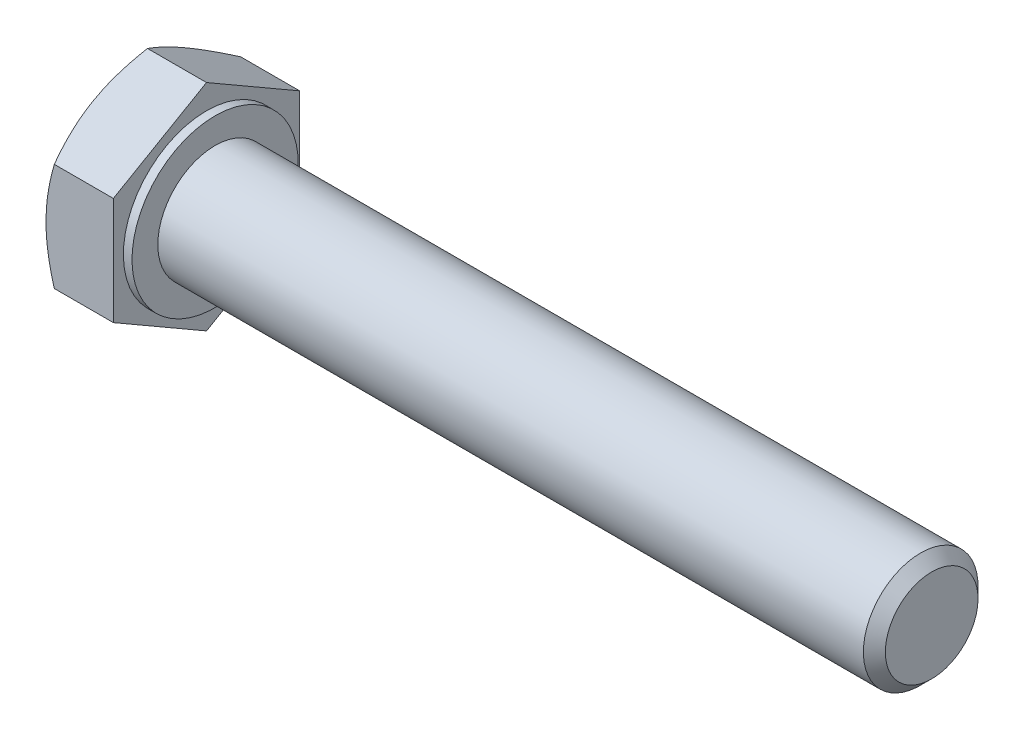
ISO-10303-21;
HEADER;
FILE_DESCRIPTION(('STEP AP214'),'2;1');
FILE_NAME('part.step','',(''),(''),'','','');
FILE_SCHEMA(('AUTOMOTIVE_DESIGN { 1 0 10303 214 1 1 1 1 }'));
ENDSEC;
DATA;
#1=APPLICATION_CONTEXT('core data for automotive mechanical design processes');
#2=APPLICATION_PROTOCOL_DEFINITION('international standard','automotive_design',2000,#1);
#3=PRODUCT_CONTEXT('',#1,'mechanical');
#4=PRODUCT('Part','Part','',(#3));
#5=PRODUCT_RELATED_PRODUCT_CATEGORY('part','',(#4));
#6=PRODUCT_DEFINITION_FORMATION('','',#4);
#7=PRODUCT_DEFINITION_CONTEXT('part definition',#1,'design');
#8=PRODUCT_DEFINITION('design','',#6,#7);
#9=PRODUCT_DEFINITION_SHAPE('','',#8);
#10=(LENGTH_UNIT() NAMED_UNIT(*) SI_UNIT(.MILLI.,.METRE.));
#11=(NAMED_UNIT(*) PLANE_ANGLE_UNIT() SI_UNIT($,.RADIAN.));
#12=(NAMED_UNIT(*) SI_UNIT($,.STERADIAN.) SOLID_ANGLE_UNIT());
#13=UNCERTAINTY_MEASURE_WITH_UNIT(LENGTH_MEASURE(1.E-05),#10,'distance_accuracy_value','');
#14=(GEOMETRIC_REPRESENTATION_CONTEXT(3) GLOBAL_UNCERTAINTY_ASSIGNED_CONTEXT((#13)) GLOBAL_UNIT_ASSIGNED_CONTEXT((#10,
#11,#12)) REPRESENTATION_CONTEXT('',''));
#15=CARTESIAN_POINT('',(0.,0.,0.));
#16=DIRECTION('',(0.,0.,1.));
#17=DIRECTION('',(1.,0.,0.));
#18=AXIS2_PLACEMENT_3D('',#15,#16,#17);
#19=CARTESIAN_POINT('',(49.61654375,0.,0.));
#20=DIRECTION('',(-1.,0.,0.));
#21=DIRECTION('',(0.,1.,0.));
#22=AXIS2_PLACEMENT_3D('',#19,#20,#21);
#23=CONICAL_SURFACE('',#22,3.61659375,0.785332962660773);
#24=CARTESIAN_POINT('',(49.2330875,0.,0.));
#25=DIRECTION('',(1.,0.,0.));
#26=DIRECTION('',(0.,1.,0.));
#27=AXIS2_PLACEMENT_3D('',#24,#25,#26);
#28=CIRCLE('',#27,4.);
#29=CARTESIAN_POINT('',(49.2330875,4.00000000000001,0.));
#30=VERTEX_POINT('',#29);
#31=EDGE_CURVE('E10',#30,#30,#28,.T.);
#32=ORIENTED_EDGE('',*,*,#31,.T.);
#33=EDGE_LOOP('',(#32));
#34=FACE_BOUND('',#33,.T.);
#35=CARTESIAN_POINT('',(50.,0.,0.));
#36=DIRECTION('',(-1.,0.,0.));
#37=DIRECTION('',(0.,1.,0.));
#38=AXIS2_PLACEMENT_3D('',#35,#36,#37);
#39=CIRCLE('',#38,3.2331875);
#40=CARTESIAN_POINT('',(50.,3.23318750000001,0.));
#41=VERTEX_POINT('',#40);
#42=EDGE_CURVE('E26',#41,#41,#39,.T.);
#43=ORIENTED_EDGE('',*,*,#42,.T.);
#44=EDGE_LOOP('',(#43));
#45=FACE_BOUND('',#44,.T.);
#46=ADVANCED_FACE('F16',(#34,#45),#23,.T.);
#47=CARTESIAN_POINT('',(39.,0.,0.));
#48=DIRECTION('',(1.,0.,0.));
#49=DIRECTION('',(0.,1.,0.));
#50=AXIS2_PLACEMENT_3D('',#47,#48,#49);
#51=CYLINDRICAL_SURFACE('',#50,4.);
#52=CARTESIAN_POINT('',(0.,0.,0.));
#53=DIRECTION('',(1.,0.,0.));
#54=DIRECTION('',(0.,1.,0.));
#55=AXIS2_PLACEMENT_3D('',#52,#53,#54);
#56=CIRCLE('',#55,4.);
#57=CARTESIAN_POINT('',(0.,4.,0.));
#58=VERTEX_POINT('',#57);
#59=EDGE_CURVE('E165',#58,#58,#56,.T.);
#60=ORIENTED_EDGE('',*,*,#59,.T.);
#61=EDGE_LOOP('',(#60));
#62=FACE_BOUND('',#61,.T.);
#63=ORIENTED_EDGE('',*,*,#31,.F.);
#64=EDGE_LOOP('',(#63));
#65=FACE_BOUND('',#64,.T.);
#66=ADVANCED_FACE('F251',(#62,#65),#51,.T.);
#67=CARTESIAN_POINT('',(50.,2.00000000000001,0.));
#68=DIRECTION('',(1.,0.,0.));
#69=DIRECTION('',(0.,1.,0.));
#70=AXIS2_PLACEMENT_3D('',#67,#68,#69);
#71=PLANE('',#70);
#72=ORIENTED_EDGE('',*,*,#42,.F.);
#73=EDGE_LOOP('',(#72));
#74=FACE_BOUND('',#73,.T.);
#75=ADVANCED_FACE('F248',(#74),#71,.T.);
#76=CARTESIAN_POINT('',(-5.00982170819963,0.,0.));
#77=DIRECTION('',(1.,0.,0.));
#78=DIRECTION('',(0.,0.,1.));
#79=AXIS2_PLACEMENT_3D('',#76,#77,#78);
#80=CONICAL_SURFACE('',#79,7.00277674973256,1.0471975511966);
#81=CARTESIAN_POINT('',(-5.30010000000001,5.62916512459884,3.25));
#82=CARTESIAN_POINT('',(-5.30010000000001,4.7583302491977,4.75833024919769));
#83=CARTESIAN_POINT('',(-4.71954341639926,3.75277674973257,6.49999999999997));
#84=(BOUNDED_CURVE() B_SPLINE_CURVE(2,(#81,#82,#83),.UNSPECIFIED.,.F.,
.F.) B_SPLINE_CURVE_WITH_KNOTS((3,3),(0.380711317203905,0.76142263440781),
.UNSPECIFIED.) CURVE() GEOMETRIC_REPRESENTATION_ITEM() RATIONAL_B_SPLINE_CURVE((1.,
1.03795484930203,1.)) REPRESENTATION_ITEM(''));
#85=CARTESIAN_POINT('',(-5.30010000000001,5.62916512459884,3.25));
#86=VERTEX_POINT('',#85);
#87=CARTESIAN_POINT('',(-4.71954341639926,3.75277674973253,6.5));
#88=VERTEX_POINT('',#87);
#89=EDGE_CURVE('E140',#86,#88,#84,.T.);
#90=ORIENTED_EDGE('',*,*,#89,.F.);
#91=CARTESIAN_POINT('',(-5.30009999999999,0.,0.));
#92=DIRECTION('',(-1.,0.,0.));
#93=DIRECTION('',(0.,1.,0.));
#94=AXIS2_PLACEMENT_3D('',#91,#92,#93);
#95=CIRCLE('',#94,6.50000000000003);
#96=CARTESIAN_POINT('',(-5.30010000000001,0.,6.5));
#97=VERTEX_POINT('',#96);
#98=EDGE_CURVE('E118',#97,#86,#95,.T.);
#99=ORIENTED_EDGE('',*,*,#98,.F.);
#100=CARTESIAN_POINT('',(-4.71954341639926,3.75277674973253,6.5));
#101=CARTESIAN_POINT('',(-5.30010000000001,1.74166975080228,6.5));
#102=CARTESIAN_POINT('',(-5.30010000000001,0.,6.5));
#103=(BOUNDED_CURVE() B_SPLINE_CURVE(2,(#100,#101,#102),.UNSPECIFIED.,.F.,
.F.) B_SPLINE_CURVE_WITH_KNOTS((3,3),(0.,0.380711317203905),
.UNSPECIFIED.) CURVE() GEOMETRIC_REPRESENTATION_ITEM() RATIONAL_B_SPLINE_CURVE((1.,
1.03795484930204,1.)) REPRESENTATION_ITEM(''));
#104=EDGE_CURVE('E135',#88,#97,#103,.T.);
#105=ORIENTED_EDGE('',*,*,#104,.F.);
#106=EDGE_LOOP('',(#90,#99,#105));
#107=FACE_BOUND('',#106,.T.);
#108=ADVANCED_FACE('F250',(#107),#80,.T.);
#109=CARTESIAN_POINT('',(-5.00982170819963,0.,0.));
#110=DIRECTION('',(1.,0.,0.));
#111=DIRECTION('',(0.,0.,1.));
#112=AXIS2_PLACEMENT_3D('',#109,#110,#111);
#113=CONICAL_SURFACE('',#112,7.00277674973256,1.0471975511966);
#114=CARTESIAN_POINT('',(-4.71954341639926,-3.75277674973259,6.49999999999996));
#115=CARTESIAN_POINT('',(-5.30010000000001,-4.75833024919771,4.75833024919768));
#116=CARTESIAN_POINT('',(-5.30010000000001,-5.62916512459885,3.24999999999999));
#117=(BOUNDED_CURVE() B_SPLINE_CURVE(2,(#114,#115,#116),.UNSPECIFIED.,.F.,
.F.) B_SPLINE_CURVE_WITH_KNOTS((3,3),(0.,0.380711317203904),
.UNSPECIFIED.) CURVE() GEOMETRIC_REPRESENTATION_ITEM() RATIONAL_B_SPLINE_CURVE((1.,
1.03795484930205,1.)) REPRESENTATION_ITEM(''));
#118=CARTESIAN_POINT('',(-4.71954341639926,-3.75277674973254,6.49999999999999));
#119=VERTEX_POINT('',#118);
#120=CARTESIAN_POINT('',(-5.30010000000001,-5.62916512459885,3.24999999999999));
#121=VERTEX_POINT('',#120);
#122=EDGE_CURVE('E116',#119,#121,#117,.T.);
#123=ORIENTED_EDGE('',*,*,#122,.F.);
#124=CARTESIAN_POINT('',(-5.30010000000001,0.,6.5));
#125=CARTESIAN_POINT('',(-5.30010000000001,-1.74166975080229,6.49999999999999));
#126=CARTESIAN_POINT('',(-4.71954341639926,-3.75277674973254,6.49999999999999));
#127=(BOUNDED_CURVE() B_SPLINE_CURVE(2,(#124,#125,#126),.UNSPECIFIED.,.F.,
.F.) B_SPLINE_CURVE_WITH_KNOTS((3,3),(0.380711317203905,0.76142263440781),
.UNSPECIFIED.) CURVE() GEOMETRIC_REPRESENTATION_ITEM() RATIONAL_B_SPLINE_CURVE((1.,
1.03795484930202,1.)) REPRESENTATION_ITEM(''));
#128=EDGE_CURVE('E134',#97,#119,#127,.T.);
#129=ORIENTED_EDGE('',*,*,#128,.F.);
#130=CARTESIAN_POINT('',(-5.30009999999999,0.,0.));
#131=DIRECTION('',(-1.,0.,0.));
#132=DIRECTION('',(0.,1.,0.));
#133=AXIS2_PLACEMENT_3D('',#130,#131,#132);
#134=CIRCLE('',#133,6.50000000000003);
#135=EDGE_CURVE('E125',#121,#97,#134,.T.);
#136=ORIENTED_EDGE('',*,*,#135,.F.);
#137=EDGE_LOOP('',(#123,#129,#136));
#138=FACE_BOUND('',#137,.T.);
#139=ADVANCED_FACE('F258',(#138),#113,.T.);
#140=CARTESIAN_POINT('',(-5.00982170819963,0.,0.));
#141=DIRECTION('',(1.,0.,0.));
#142=DIRECTION('',(0.,0.,1.));
#143=AXIS2_PLACEMENT_3D('',#140,#141,#142);
#144=CONICAL_SURFACE('',#143,7.00277674973256,1.0471975511966);
#145=CARTESIAN_POINT('',(-5.30010000000001,5.62916512459885,-3.24999999999999));
#146=CARTESIAN_POINT('',(-5.30010000000001,6.49999999999999,-1.74166975080229));
#147=CARTESIAN_POINT('',(-4.71954341639926,7.50555349946511,0.));
#148=(BOUNDED_CURVE() B_SPLINE_CURVE(2,(#145,#146,#147),.UNSPECIFIED.,.F.,
.F.) B_SPLINE_CURVE_WITH_KNOTS((3,3),(0.380711317203905,0.76142263440781),
.UNSPECIFIED.) CURVE() GEOMETRIC_REPRESENTATION_ITEM() RATIONAL_B_SPLINE_CURVE((1.,
1.03795484930206,1.)) REPRESENTATION_ITEM(''));
#149=CARTESIAN_POINT('',(-5.30010000000001,5.62916512459885,-3.24999999999999));
#150=VERTEX_POINT('',#149);
#151=CARTESIAN_POINT('',(-4.71954341639926,7.50555349946511,0.));
#152=VERTEX_POINT('',#151);
#153=EDGE_CURVE('E148',#150,#152,#148,.T.);
#154=ORIENTED_EDGE('',*,*,#153,.F.);
#155=CARTESIAN_POINT('',(-5.30009999999999,0.,0.));
#156=DIRECTION('',(-1.,0.,0.));
#157=DIRECTION('',(0.,1.,0.));
#158=AXIS2_PLACEMENT_3D('',#155,#156,#157);
#159=CIRCLE('',#158,6.50000000000003);
#160=EDGE_CURVE('E35',#86,#150,#159,.T.);
#161=ORIENTED_EDGE('',*,*,#160,.F.);
#162=CARTESIAN_POINT('',(-4.71954341639926,7.50555349946512,0.));
#163=CARTESIAN_POINT('',(-5.30010000000001,6.49999999999999,1.74166975080231));
#164=CARTESIAN_POINT('',(-5.30010000000001,5.62916512459884,3.25));
#165=(BOUNDED_CURVE() B_SPLINE_CURVE(2,(#162,#163,#164),.UNSPECIFIED.,.F.,
.F.) B_SPLINE_CURVE_WITH_KNOTS((3,3),(0.,0.380711317203905),
.UNSPECIFIED.) CURVE() GEOMETRIC_REPRESENTATION_ITEM() RATIONAL_B_SPLINE_CURVE((1.,
1.03795484930205,1.)) REPRESENTATION_ITEM(''));
#166=EDGE_CURVE('E149',#152,#86,#165,.T.);
#167=ORIENTED_EDGE('',*,*,#166,.F.);
#168=EDGE_LOOP('',(#154,#161,#167));
#169=FACE_BOUND('',#168,.T.);
#170=ADVANCED_FACE('F275',(#169),#144,.T.);
#171=CARTESIAN_POINT('',(-5.00982170819963,0.,0.));
#172=DIRECTION('',(1.,0.,0.));
#173=DIRECTION('',(0.,0.,1.));
#174=AXIS2_PLACEMENT_3D('',#171,#172,#173);
#175=CONICAL_SURFACE('',#174,7.00277674973256,1.0471975511966);
#176=CARTESIAN_POINT('',(-4.71954341639926,-7.50555349946512,0.));
#177=CARTESIAN_POINT('',(-5.30010000000001,-6.49999999999999,-1.74166975080231));
#178=CARTESIAN_POINT('',(-5.30010000000001,-5.62916512459885,-3.25));
#179=(BOUNDED_CURVE() B_SPLINE_CURVE(2,(#176,#177,#178),.UNSPECIFIED.,.F.,
.F.) B_SPLINE_CURVE_WITH_KNOTS((3,3),(0.,0.380711317203904),
.UNSPECIFIED.) CURVE() GEOMETRIC_REPRESENTATION_ITEM() RATIONAL_B_SPLINE_CURVE((1.,
1.03795484930205,1.)) REPRESENTATION_ITEM(''));
#180=CARTESIAN_POINT('',(-4.71954341639926,-7.50555349946511,0.));
#181=VERTEX_POINT('',#180);
#182=CARTESIAN_POINT('',(-5.30010000000001,-5.62916512459885,-3.25));
#183=VERTEX_POINT('',#182);
#184=EDGE_CURVE('E115',#181,#183,#179,.T.);
#185=ORIENTED_EDGE('',*,*,#184,.F.);
#186=CARTESIAN_POINT('',(-5.30010000000001,-5.62916512459885,3.24999999999999));
#187=CARTESIAN_POINT('',(-5.30010000000001,-6.49999999999999,1.74166975080231));
#188=CARTESIAN_POINT('',(-4.71954341639926,-7.50555349946511,0.));
#189=(BOUNDED_CURVE() B_SPLINE_CURVE(2,(#186,#187,#188),.UNSPECIFIED.,.F.,
.F.) B_SPLINE_CURVE_WITH_KNOTS((3,3),(0.380711317203904,0.761422634407808),
.UNSPECIFIED.) CURVE() GEOMETRIC_REPRESENTATION_ITEM() RATIONAL_B_SPLINE_CURVE((1.,
1.03795484930205,1.)) REPRESENTATION_ITEM(''));
#190=EDGE_CURVE('E113',#121,#181,#189,.T.);
#191=ORIENTED_EDGE('',*,*,#190,.F.);
#192=CARTESIAN_POINT('',(-5.30009999999999,0.,0.));
#193=DIRECTION('',(-1.,0.,0.));
#194=DIRECTION('',(0.,1.,0.));
#195=AXIS2_PLACEMENT_3D('',#192,#193,#194);
#196=CIRCLE('',#195,6.50000000000003);
#197=EDGE_CURVE('E153',#183,#121,#196,.T.);
#198=ORIENTED_EDGE('',*,*,#197,.F.);
#199=EDGE_LOOP('',(#185,#191,#198));
#200=FACE_BOUND('',#199,.T.);
#201=ADVANCED_FACE('F279',(#200),#175,.T.);
#202=CARTESIAN_POINT('',(-5.00982170819963,0.,0.));
#203=DIRECTION('',(1.,0.,0.));
#204=DIRECTION('',(0.,0.,1.));
#205=AXIS2_PLACEMENT_3D('',#202,#203,#204);
#206=CONICAL_SURFACE('',#205,7.00277674973256,1.0471975511966);
#207=CARTESIAN_POINT('',(-5.30010000000001,0.,-6.5));
#208=CARTESIAN_POINT('',(-5.30010000000001,1.74166975080229,-6.5));
#209=CARTESIAN_POINT('',(-4.71954341639926,3.75277674973254,-6.49999999999999));
#210=(BOUNDED_CURVE() B_SPLINE_CURVE(2,(#207,#208,#209),.UNSPECIFIED.,.F.,
.F.) B_SPLINE_CURVE_WITH_KNOTS((3,3),(0.380711317203905,0.761422634407809),
.UNSPECIFIED.) CURVE() GEOMETRIC_REPRESENTATION_ITEM() RATIONAL_B_SPLINE_CURVE((1.,
1.03795484930204,1.)) REPRESENTATION_ITEM(''));
#211=CARTESIAN_POINT('',(-5.30010000000001,0.,-6.5));
#212=VERTEX_POINT('',#211);
#213=CARTESIAN_POINT('',(-4.71954341639926,3.75277674973253,-6.5));
#214=VERTEX_POINT('',#213);
#215=EDGE_CURVE('E142',#212,#214,#210,.T.);
#216=ORIENTED_EDGE('',*,*,#215,.F.);
#217=CARTESIAN_POINT('',(-5.30009999999999,0.,0.));
#218=DIRECTION('',(-1.,0.,0.));
#219=DIRECTION('',(0.,1.,0.));
#220=AXIS2_PLACEMENT_3D('',#217,#218,#219);
#221=CIRCLE('',#220,6.50000000000003);
#222=EDGE_CURVE('E152',#150,#212,#221,.T.);
#223=ORIENTED_EDGE('',*,*,#222,.F.);
#224=CARTESIAN_POINT('',(-4.71954341639926,3.75277674973258,-6.49999999999997));
#225=CARTESIAN_POINT('',(-5.30010000000001,4.7583302491977,-4.75833024919769));
#226=CARTESIAN_POINT('',(-5.30010000000001,5.62916512459885,-3.24999999999999));
#227=(BOUNDED_CURVE() B_SPLINE_CURVE(2,(#224,#225,#226),.UNSPECIFIED.,.F.,
.F.) B_SPLINE_CURVE_WITH_KNOTS((3,3),(0.,0.380711317203905),
.UNSPECIFIED.) CURVE() GEOMETRIC_REPRESENTATION_ITEM() RATIONAL_B_SPLINE_CURVE((1.,
1.03795484930205,1.)) REPRESENTATION_ITEM(''));
#228=EDGE_CURVE('E143',#214,#150,#227,.T.);
#229=ORIENTED_EDGE('',*,*,#228,.F.);
#230=EDGE_LOOP('',(#216,#223,#229));
#231=FACE_BOUND('',#230,.T.);
#232=ADVANCED_FACE('F282',(#231),#206,.T.);
#233=CARTESIAN_POINT('',(-5.00982170819963,0.,0.));
#234=DIRECTION('',(1.,0.,0.));
#235=DIRECTION('',(0.,0.,1.));
#236=AXIS2_PLACEMENT_3D('',#233,#234,#235);
#237=CONICAL_SURFACE('',#236,7.00277674973256,1.0471975511966);
#238=CARTESIAN_POINT('',(-4.71954341639926,-3.75277674973253,-6.5));
#239=CARTESIAN_POINT('',(-5.30010000000001,-1.74166975080229,-6.5));
#240=CARTESIAN_POINT('',(-5.30010000000001,0.,-6.5));
#241=(BOUNDED_CURVE() B_SPLINE_CURVE(2,(#238,#239,#240),.UNSPECIFIED.,.F.,
.F.) B_SPLINE_CURVE_WITH_KNOTS((3,3),(0.,0.380711317203905),
.UNSPECIFIED.) CURVE() GEOMETRIC_REPRESENTATION_ITEM() RATIONAL_B_SPLINE_CURVE((1.,
1.03795484930204,1.)) REPRESENTATION_ITEM(''));
#242=CARTESIAN_POINT('',(-4.71954341639926,-3.75277674973258,-6.49999999999997));
#243=VERTEX_POINT('',#242);
#244=EDGE_CURVE('E157',#243,#212,#241,.T.);
#245=ORIENTED_EDGE('',*,*,#244,.F.);
#246=CARTESIAN_POINT('',(-5.30010000000001,-5.62916512459885,-3.25));
#247=CARTESIAN_POINT('',(-5.30010000000001,-4.7583302491977,-4.75833024919769));
#248=CARTESIAN_POINT('',(-4.71954341639926,-3.75277674973258,-6.49999999999997));
#249=(BOUNDED_CURVE() B_SPLINE_CURVE(2,(#246,#247,#248),.UNSPECIFIED.,.F.,
.F.) B_SPLINE_CURVE_WITH_KNOTS((3,3),(0.380711317203904,0.761422634407809),
.UNSPECIFIED.) CURVE() GEOMETRIC_REPRESENTATION_ITEM() RATIONAL_B_SPLINE_CURVE((1.,
1.03795484930204,1.)) REPRESENTATION_ITEM(''));
#250=EDGE_CURVE('E114',#183,#243,#249,.T.);
#251=ORIENTED_EDGE('',*,*,#250,.F.);
#252=CARTESIAN_POINT('',(-5.30009999999999,0.,0.));
#253=DIRECTION('',(-1.,0.,0.));
#254=DIRECTION('',(0.,1.,0.));
#255=AXIS2_PLACEMENT_3D('',#252,#253,#254);
#256=CIRCLE('',#255,6.50000000000003);
#257=EDGE_CURVE('E150',#212,#183,#256,.T.);
#258=ORIENTED_EDGE('',*,*,#257,.F.);
#259=EDGE_LOOP('',(#245,#251,#258));
#260=FACE_BOUND('',#259,.T.);
#261=ADVANCED_FACE('F285',(#260),#237,.T.);
#262=CARTESIAN_POINT('',(-0.600099999999993,-3.75277674973256,-6.5));
#263=DIRECTION('',(0.,0.,-1.));
#264=DIRECTION('',(0.,1.,0.));
#265=AXIS2_PLACEMENT_3D('',#262,#263,#264);
#266=PLANE('',#265);
#267=ORIENTED_EDGE('',*,*,#244,.T.);
#268=ORIENTED_EDGE('',*,*,#215,.T.);
#269=DIRECTION('',(-1.,0.,0.));
#270=VECTOR('',#269,1.);
#271=CARTESIAN_POINT('',(-0.600099999999994,3.75277674973256,-6.49999999999999));
#272=LINE('',#271,#270);
#273=CARTESIAN_POINT('',(-0.600099999999994,3.75277674973256,-6.49999999999999));
#274=VERTEX_POINT('',#273);
#275=EDGE_CURVE('E145',#274,#214,#272,.T.);
#276=ORIENTED_EDGE('',*,*,#275,.F.);
#277=DIRECTION('',(0.,1.,0.));
#278=VECTOR('',#277,1.);
#279=CARTESIAN_POINT('',(-0.600099999999993,-3.75277674973256,-6.5));
#280=LINE('',#279,#278);
#281=CARTESIAN_POINT('',(-0.600099999999993,-3.75277674973256,-6.5));
#282=VERTEX_POINT('',#281);
#283=EDGE_CURVE('E100',#282,#274,#280,.T.);
#284=ORIENTED_EDGE('',*,*,#283,.F.);
#285=DIRECTION('',(-1.,0.,0.));
#286=VECTOR('',#285,1.);
#287=CARTESIAN_POINT('',(-0.600099999999993,-3.75277674973256,-6.5));
#288=LINE('',#287,#286);
#289=EDGE_CURVE('E98',#282,#243,#288,.T.);
#290=ORIENTED_EDGE('',*,*,#289,.T.);
#291=EDGE_LOOP('',(#267,#268,#276,#284,#290));
#292=FACE_BOUND('',#291,.T.);
#293=ADVANCED_FACE('F288',(#292),#266,.T.);
#294=CARTESIAN_POINT('',(-0.600099999999994,3.75277674973256,-6.49999999999999));
#295=DIRECTION('',(0.,0.866025403784439,-0.5));
#296=DIRECTION('',(0.,0.5,0.866025403784439));
#297=AXIS2_PLACEMENT_3D('',#294,#295,#296);
#298=PLANE('',#297);
#299=ORIENTED_EDGE('',*,*,#228,.T.);
#300=ORIENTED_EDGE('',*,*,#153,.T.);
#301=DIRECTION('',(-1.,0.,0.));
#302=VECTOR('',#301,1.);
#303=CARTESIAN_POINT('',(-0.600099999999995,7.50555349946513,0.));
#304=LINE('',#303,#302);
#305=CARTESIAN_POINT('',(-0.600099999999995,7.50555349946513,0.));
#306=VERTEX_POINT('',#305);
#307=EDGE_CURVE('E130',#306,#152,#304,.T.);
#308=ORIENTED_EDGE('',*,*,#307,.F.);
#309=DIRECTION('',(0.,0.5,0.866025403784439));
#310=VECTOR('',#309,1.);
#311=CARTESIAN_POINT('',(-0.600099999999994,3.75277674973256,-6.49999999999999));
#312=LINE('',#311,#310);
#313=EDGE_CURVE('E136',#274,#306,#312,.T.);
#314=ORIENTED_EDGE('',*,*,#313,.F.);
#315=ORIENTED_EDGE('',*,*,#275,.T.);
#316=EDGE_LOOP('',(#299,#300,#308,#314,#315));
#317=FACE_BOUND('',#316,.T.);
#318=ADVANCED_FACE('F293',(#317),#298,.T.);
#319=CARTESIAN_POINT('',(-0.600099999999995,7.50555349946513,0.));
#320=DIRECTION('',(0.,0.866025403784438,0.500000000000001));
#321=DIRECTION('',(0.,-0.500000000000001,0.866025403784438));
#322=AXIS2_PLACEMENT_3D('',#319,#320,#321);
#323=PLANE('',#322);
#324=ORIENTED_EDGE('',*,*,#166,.T.);
#325=ORIENTED_EDGE('',*,*,#89,.T.);
#326=DIRECTION('',(-1.,0.,0.));
#327=VECTOR('',#326,1.);
#328=CARTESIAN_POINT('',(-0.600099999999994,3.75277674973256,6.5));
#329=LINE('',#328,#327);
#330=CARTESIAN_POINT('',(-0.600099999999994,3.75277674973256,6.5));
#331=VERTEX_POINT('',#330);
#332=EDGE_CURVE('E131',#331,#88,#329,.T.);
#333=ORIENTED_EDGE('',*,*,#332,.F.);
#334=DIRECTION('',(0.,-0.500000000000001,0.866025403784438));
#335=VECTOR('',#334,1.);
#336=CARTESIAN_POINT('',(-0.600099999999995,7.50555349946513,0.));
#337=LINE('',#336,#335);
#338=EDGE_CURVE('E128',#306,#331,#337,.T.);
#339=ORIENTED_EDGE('',*,*,#338,.F.);
#340=ORIENTED_EDGE('',*,*,#307,.T.);
#341=EDGE_LOOP('',(#324,#325,#333,#339,#340));
#342=FACE_BOUND('',#341,.T.);
#343=ADVANCED_FACE('F304',(#342),#323,.T.);
#344=CARTESIAN_POINT('',(-0.600099999999994,0.,0.));
#345=DIRECTION('',(1.,0.,0.));
#346=DIRECTION('',(0.,1.,0.));
#347=AXIS2_PLACEMENT_3D('',#344,#345,#346);
#348=PLANE('',#347);
#349=ORIENTED_EDGE('',*,*,#338,.T.);
#350=DIRECTION('',(0.,-1.,0.));
#351=VECTOR('',#350,1.);
#352=CARTESIAN_POINT('',(-0.600099999999994,3.75277674973256,6.5));
#353=LINE('',#352,#351);
#354=CARTESIAN_POINT('',(-0.600099999999993,-3.75277674973257,6.49999999999999));
#355=VERTEX_POINT('',#354);
#356=EDGE_CURVE('E106',#331,#355,#353,.T.);
#357=ORIENTED_EDGE('',*,*,#356,.T.);
#358=DIRECTION('',(0.,-0.5,-0.866025403784439));
#359=VECTOR('',#358,1.);
#360=CARTESIAN_POINT('',(-0.600099999999993,-3.75277674973257,6.49999999999999));
#361=LINE('',#360,#359);
#362=CARTESIAN_POINT('',(-0.600099999999993,-7.50555349946513,0.));
#363=VERTEX_POINT('',#362);
#364=EDGE_CURVE('E86',#355,#363,#361,.T.);
#365=ORIENTED_EDGE('',*,*,#364,.T.);
#366=DIRECTION('',(0.,0.5,-0.866025403784438));
#367=VECTOR('',#366,1.);
#368=CARTESIAN_POINT('',(-0.600099999999993,-7.50555349946513,0.));
#369=LINE('',#368,#367);
#370=EDGE_CURVE('E93',#363,#282,#369,.T.);
#371=ORIENTED_EDGE('',*,*,#370,.T.);
#372=ORIENTED_EDGE('',*,*,#283,.T.);
#373=ORIENTED_EDGE('',*,*,#313,.T.);
#374=EDGE_LOOP('',(#349,#357,#365,#371,#372,#373));
#375=FACE_BOUND('',#374,.T.);
#376=CARTESIAN_POINT('',(-0.600099999999992,0.,0.));
#377=DIRECTION('',(1.,0.,0.));
#378=DIRECTION('',(0.,1.,0.));
#379=AXIS2_PLACEMENT_3D('',#376,#377,#378);
#380=CIRCLE('',#379,5.8);
#381=CARTESIAN_POINT('',(-0.600099999999992,5.8,0.));
#382=VERTEX_POINT('',#381);
#383=EDGE_CURVE('E123',#382,#382,#380,.T.);
#384=ORIENTED_EDGE('',*,*,#383,.F.);
#385=EDGE_LOOP('',(#384));
#386=FACE_BOUND('',#385,.T.);
#387=ADVANCED_FACE('F103',(#375,#386),#348,.T.);
#388=CARTESIAN_POINT('',(-0.600099999999994,3.75277674973256,6.5));
#389=DIRECTION('',(0.,0.,1.));
#390=DIRECTION('',(0.,-1.,0.));
#391=AXIS2_PLACEMENT_3D('',#388,#389,#390);
#392=PLANE('',#391);
#393=ORIENTED_EDGE('',*,*,#128,.T.);
#394=DIRECTION('',(-1.,0.,0.));
#395=VECTOR('',#394,1.);
#396=CARTESIAN_POINT('',(-0.600099999999993,-3.75277674973257,6.49999999999999));
#397=LINE('',#396,#395);
#398=EDGE_CURVE('E121',#355,#119,#397,.T.);
#399=ORIENTED_EDGE('',*,*,#398,.F.);
#400=ORIENTED_EDGE('',*,*,#356,.F.);
#401=ORIENTED_EDGE('',*,*,#332,.T.);
#402=ORIENTED_EDGE('',*,*,#104,.T.);
#403=EDGE_LOOP('',(#393,#399,#400,#401,#402));
#404=FACE_BOUND('',#403,.T.);
#405=ADVANCED_FACE('F307',(#404),#392,.T.);
#406=CARTESIAN_POINT('',(-0.600099999999993,-3.75277674973257,6.49999999999999));
#407=DIRECTION('',(0.,-0.866025403784439,0.5));
#408=DIRECTION('',(0.,-0.5,-0.866025403784439));
#409=AXIS2_PLACEMENT_3D('',#406,#407,#408);
#410=PLANE('',#409);
#411=ORIENTED_EDGE('',*,*,#190,.T.);
#412=DIRECTION('',(-1.,0.,0.));
#413=VECTOR('',#412,1.);
#414=CARTESIAN_POINT('',(-0.600099999999993,-7.50555349946513,0.));
#415=LINE('',#414,#413);
#416=EDGE_CURVE('E96',#363,#181,#415,.T.);
#417=ORIENTED_EDGE('',*,*,#416,.F.);
#418=ORIENTED_EDGE('',*,*,#364,.F.);
#419=ORIENTED_EDGE('',*,*,#398,.T.);
#420=ORIENTED_EDGE('',*,*,#122,.T.);
#421=EDGE_LOOP('',(#411,#417,#418,#419,#420));
#422=FACE_BOUND('',#421,.T.);
#423=ADVANCED_FACE('F110',(#422),#410,.T.);
#424=CARTESIAN_POINT('',(-0.600099999999993,-7.50555349946513,0.));
#425=DIRECTION('',(0.,-0.866025403784438,-0.5));
#426=DIRECTION('',(0.,0.5,-0.866025403784438));
#427=AXIS2_PLACEMENT_3D('',#424,#425,#426);
#428=PLANE('',#427);
#429=ORIENTED_EDGE('',*,*,#250,.T.);
#430=ORIENTED_EDGE('',*,*,#289,.F.);
#431=ORIENTED_EDGE('',*,*,#370,.F.);
#432=ORIENTED_EDGE('',*,*,#416,.T.);
#433=ORIENTED_EDGE('',*,*,#184,.T.);
#434=EDGE_LOOP('',(#429,#430,#431,#432,#433));
#435=FACE_BOUND('',#434,.T.);
#436=ADVANCED_FACE('F94',(#435),#428,.T.);
#437=CARTESIAN_POINT('',(-5.30009999999999,0.,0.));
#438=DIRECTION('',(1.,0.,0.));
#439=DIRECTION('',(0.,1.,0.));
#440=AXIS2_PLACEMENT_3D('',#437,#438,#439);
#441=PLANE('',#440);
#442=ORIENTED_EDGE('',*,*,#98,.T.);
#443=ORIENTED_EDGE('',*,*,#160,.T.);
#444=ORIENTED_EDGE('',*,*,#222,.T.);
#445=ORIENTED_EDGE('',*,*,#257,.T.);
#446=ORIENTED_EDGE('',*,*,#197,.T.);
#447=ORIENTED_EDGE('',*,*,#135,.T.);
#448=EDGE_LOOP('',(#442,#443,#444,#445,#446,#447));
#449=FACE_BOUND('',#448,.T.);
#450=ADVANCED_FACE('F310',(#449),#441,.F.);
#451=CARTESIAN_POINT('',(-0.300049999999992,0.,0.));
#452=DIRECTION('',(1.,0.,0.));
#453=DIRECTION('',(0.,1.,0.));
#454=AXIS2_PLACEMENT_3D('',#451,#452,#453);
#455=CYLINDRICAL_SURFACE('',#454,5.8);
#456=CARTESIAN_POINT('',(0.,0.,0.));
#457=DIRECTION('',(1.,0.,0.));
#458=DIRECTION('',(0.,1.,0.));
#459=AXIS2_PLACEMENT_3D('',#456,#457,#458);
#460=CIRCLE('',#459,5.8);
#461=CARTESIAN_POINT('',(0.,5.8,0.));
#462=VERTEX_POINT('',#461);
#463=EDGE_CURVE('E20',#462,#462,#460,.T.);
#464=ORIENTED_EDGE('',*,*,#463,.F.);
#465=EDGE_LOOP('',(#464));
#466=FACE_BOUND('',#465,.T.);
#467=ORIENTED_EDGE('',*,*,#383,.T.);
#468=EDGE_LOOP('',(#467));
#469=FACE_BOUND('',#468,.T.);
#470=ADVANCED_FACE('F18',(#466,#469),#455,.T.);
#471=CARTESIAN_POINT('',(0.,4.9,0.));
#472=DIRECTION('',(1.,0.,0.));
#473=DIRECTION('',(0.,1.,0.));
#474=AXIS2_PLACEMENT_3D('',#471,#472,#473);
#475=PLANE('',#474);
#476=ORIENTED_EDGE('',*,*,#59,.F.);
#477=EDGE_LOOP('',(#476));
#478=FACE_BOUND('',#477,.T.);
#479=ORIENTED_EDGE('',*,*,#463,.T.);
#480=EDGE_LOOP('',(#479));
#481=FACE_BOUND('',#480,.T.);
#482=ADVANCED_FACE('F270',(#478,#481),#475,.T.);
#483=CLOSED_SHELL('',(#46,#66,#75,#108,#139,#170,#201,#232,#261,#293,#318,#343,#387,#405,#423,
#436,#450,#470,#482));
#484=MANIFOLD_SOLID_BREP('B1',#483);
#485=ADVANCED_BREP_SHAPE_REPRESENTATION('',(#18,#484),#14);
#486=SHAPE_DEFINITION_REPRESENTATION(#9,#485);
ENDSEC;
END-ISO-10303-21;
